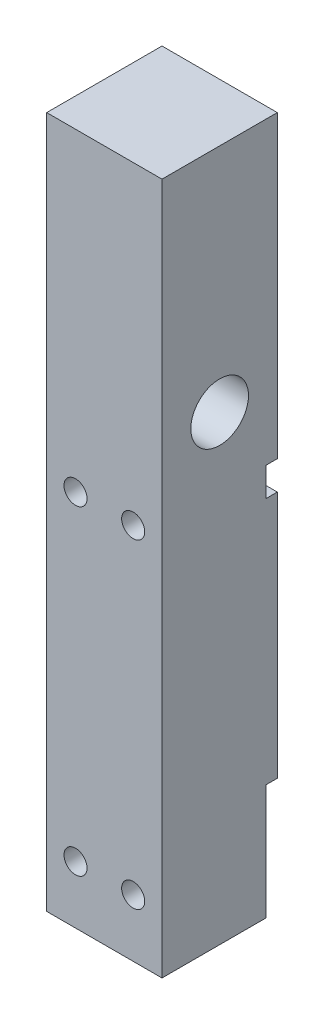
ISO-10303-21;
HEADER;
FILE_DESCRIPTION(('STEP AP214'),'2;1');
FILE_NAME('part.step','',(''),(''),'','','');
FILE_SCHEMA(('AUTOMOTIVE_DESIGN { 1 0 10303 214 1 1 1 1 }'));
ENDSEC;
DATA;
#1=APPLICATION_CONTEXT('core data for automotive mechanical design processes');
#2=APPLICATION_PROTOCOL_DEFINITION('international standard','automotive_design',2000,#1);
#3=PRODUCT_CONTEXT('',#1,'mechanical');
#4=PRODUCT('Part','Part','',(#3));
#5=PRODUCT_RELATED_PRODUCT_CATEGORY('part','',(#4));
#6=PRODUCT_DEFINITION_FORMATION('','',#4);
#7=PRODUCT_DEFINITION_CONTEXT('part definition',#1,'design');
#8=PRODUCT_DEFINITION('design','',#6,#7);
#9=PRODUCT_DEFINITION_SHAPE('','',#8);
#10=(LENGTH_UNIT() NAMED_UNIT(*) SI_UNIT(.MILLI.,.METRE.));
#11=(NAMED_UNIT(*) PLANE_ANGLE_UNIT() SI_UNIT($,.RADIAN.));
#12=(NAMED_UNIT(*) SI_UNIT($,.STERADIAN.) SOLID_ANGLE_UNIT());
#13=UNCERTAINTY_MEASURE_WITH_UNIT(LENGTH_MEASURE(1.E-05),#10,'distance_accuracy_value','');
#14=(GEOMETRIC_REPRESENTATION_CONTEXT(3) GLOBAL_UNCERTAINTY_ASSIGNED_CONTEXT((#13)) GLOBAL_UNIT_ASSIGNED_CONTEXT((#10,
#11,#12)) REPRESENTATION_CONTEXT('',''));
#15=CARTESIAN_POINT('',(0.,0.,0.));
#16=DIRECTION('',(0.,0.,1.));
#17=DIRECTION('',(1.,0.,0.));
#18=AXIS2_PLACEMENT_3D('',#15,#16,#17);
#19=CARTESIAN_POINT('',(-20.,120.,-20.));
#20=DIRECTION('',(0.,0.,-1.));
#21=DIRECTION('',(0.,1.,0.));
#22=AXIS2_PLACEMENT_3D('',#19,#20,#21);
#23=PLANE('',#22);
#24=DIRECTION('',(-1.,0.,0.));
#25=VECTOR('',#24,1.);
#26=CARTESIAN_POINT('',(0.,63.,-20.));
#27=LINE('',#26,#25);
#28=CARTESIAN_POINT('',(0.,63.,-20.));
#29=VERTEX_POINT('',#28);
#30=CARTESIAN_POINT('',(-20.,63.,-20.));
#31=VERTEX_POINT('',#30);
#32=EDGE_CURVE('E134',#29,#31,#27,.T.);
#33=ORIENTED_EDGE('',*,*,#32,.F.);
#34=DIRECTION('',(0.,1.,0.));
#35=VECTOR('',#34,1.);
#36=CARTESIAN_POINT('',(0.,120.,-20.));
#37=LINE('',#36,#35);
#38=CARTESIAN_POINT('',(0.,20.,-20.));
#39=VERTEX_POINT('',#38);
#40=EDGE_CURVE('E229',#39,#29,#37,.T.);
#41=ORIENTED_EDGE('',*,*,#40,.F.);
#42=DIRECTION('',(1.,0.,0.));
#43=VECTOR('',#42,1.);
#44=CARTESIAN_POINT('',(0.,20.,-20.));
#45=LINE('',#44,#43);
#46=CARTESIAN_POINT('',(-20.,20.,-20.));
#47=VERTEX_POINT('',#46);
#48=EDGE_CURVE('E148',#47,#39,#45,.T.);
#49=ORIENTED_EDGE('',*,*,#48,.F.);
#50=DIRECTION('',(0.,1.,0.));
#51=VECTOR('',#50,1.);
#52=CARTESIAN_POINT('',(-20.,120.,-20.));
#53=LINE('',#52,#51);
#54=EDGE_CURVE('E217',#47,#31,#53,.T.);
#55=ORIENTED_EDGE('',*,*,#54,.T.);
#56=EDGE_LOOP('',(#33,#41,#49,#55));
#57=FACE_BOUND('',#56,.T.);
#58=ADVANCED_FACE('F40',(#57),#23,.T.);
#59=CARTESIAN_POINT('',(-5.,9.99999999999999,-20.));
#60=DIRECTION('',(0.,0.,1.));
#61=DIRECTION('',(1.,0.,0.));
#62=AXIS2_PLACEMENT_3D('',#59,#60,#61);
#63=CYLINDRICAL_SURFACE('',#62,1.);
#64=CARTESIAN_POINT('',(-5.,9.99999999999999,-5.));
#65=DIRECTION('',(0.,0.,1.));
#66=DIRECTION('',(1.,0.,0.));
#67=AXIS2_PLACEMENT_3D('',#64,#65,#66);
#68=CIRCLE('',#67,1.);
#69=CARTESIAN_POINT('',(-4.,9.99999999999999,-5.));
#70=VERTEX_POINT('',#69);
#71=EDGE_CURVE('E204',#70,#70,#68,.T.);
#72=ORIENTED_EDGE('',*,*,#71,.T.);
#73=EDGE_LOOP('',(#72));
#74=FACE_BOUND('',#73,.T.);
#75=CARTESIAN_POINT('',(-5.,9.99999999999999,-18.));
#76=DIRECTION('',(0.,0.,-1.));
#77=DIRECTION('',(-1.,0.,0.));
#78=AXIS2_PLACEMENT_3D('',#75,#76,#77);
#79=CIRCLE('',#78,1.);
#80=CARTESIAN_POINT('',(-6.,9.99999999999999,-18.));
#81=VERTEX_POINT('',#80);
#82=EDGE_CURVE('E167',#81,#81,#79,.T.);
#83=ORIENTED_EDGE('',*,*,#82,.T.);
#84=EDGE_LOOP('',(#83));
#85=FACE_BOUND('',#84,.T.);
#86=ADVANCED_FACE('F305',(#74,#85),#63,.F.);
#87=CARTESIAN_POINT('',(-15.,9.99999999999999,-20.));
#88=DIRECTION('',(0.,0.,1.));
#89=DIRECTION('',(1.,0.,0.));
#90=AXIS2_PLACEMENT_3D('',#87,#88,#89);
#91=CYLINDRICAL_SURFACE('',#90,1.);
#92=CARTESIAN_POINT('',(-15.,9.99999999999999,-5.));
#93=DIRECTION('',(0.,0.,1.));
#94=DIRECTION('',(1.,0.,0.));
#95=AXIS2_PLACEMENT_3D('',#92,#93,#94);
#96=CIRCLE('',#95,1.);
#97=CARTESIAN_POINT('',(-14.,9.99999999999999,-5.));
#98=VERTEX_POINT('',#97);
#99=EDGE_CURVE('E194',#98,#98,#96,.F.);
#100=ORIENTED_EDGE('',*,*,#99,.F.);
#101=EDGE_LOOP('',(#100));
#102=FACE_BOUND('',#101,.T.);
#103=CARTESIAN_POINT('',(-15.,9.99999999999999,-18.));
#104=DIRECTION('',(0.,0.,-1.));
#105=DIRECTION('',(-1.,0.,0.));
#106=AXIS2_PLACEMENT_3D('',#103,#104,#105);
#107=CIRCLE('',#106,1.);
#108=CARTESIAN_POINT('',(-16.,9.99999999999999,-18.));
#109=VERTEX_POINT('',#108);
#110=EDGE_CURVE('E164',#109,#109,#107,.F.);
#111=ORIENTED_EDGE('',*,*,#110,.F.);
#112=EDGE_LOOP('',(#111));
#113=FACE_BOUND('',#112,.T.);
#114=ADVANCED_FACE('F309',(#102,#113),#91,.F.);
#115=CARTESIAN_POINT('',(-20.,0.,0.));
#116=DIRECTION('',(0.,-1.,0.));
#117=DIRECTION('',(0.,0.,-1.));
#118=AXIS2_PLACEMENT_3D('',#115,#116,#117);
#119=PLANE('',#118);
#120=DIRECTION('',(0.,0.,-1.));
#121=VECTOR('',#120,1.);
#122=CARTESIAN_POINT('',(-20.,0.,0.));
#123=LINE('',#122,#121);
#124=CARTESIAN_POINT('',(-20.,0.,0.));
#125=VERTEX_POINT('',#124);
#126=CARTESIAN_POINT('',(-20.,0.,-18.));
#127=VERTEX_POINT('',#126);
#128=EDGE_CURVE('E212',#125,#127,#123,.T.);
#129=ORIENTED_EDGE('',*,*,#128,.T.);
#130=DIRECTION('',(-1.,0.,0.));
#131=VECTOR('',#130,1.);
#132=CARTESIAN_POINT('',(0.,0.,-18.));
#133=LINE('',#132,#131);
#134=CARTESIAN_POINT('',(0.,0.,-18.));
#135=VERTEX_POINT('',#134);
#136=EDGE_CURVE('E152',#135,#127,#133,.T.);
#137=ORIENTED_EDGE('',*,*,#136,.F.);
#138=DIRECTION('',(0.,0.,-1.));
#139=VECTOR('',#138,1.);
#140=CARTESIAN_POINT('',(0.,0.,0.));
#141=LINE('',#140,#139);
#142=CARTESIAN_POINT('',(0.,0.,0.));
#143=VERTEX_POINT('',#142);
#144=EDGE_CURVE('E224',#143,#135,#141,.T.);
#145=ORIENTED_EDGE('',*,*,#144,.F.);
#146=DIRECTION('',(1.,0.,0.));
#147=VECTOR('',#146,1.);
#148=CARTESIAN_POINT('',(-20.,0.,0.));
#149=LINE('',#148,#147);
#150=EDGE_CURVE('E221',#125,#143,#149,.T.);
#151=ORIENTED_EDGE('',*,*,#150,.F.);
#152=EDGE_LOOP('',(#129,#137,#145,#151));
#153=FACE_BOUND('',#152,.T.);
#154=ADVANCED_FACE('F286',(#153),#119,.T.);
#155=CARTESIAN_POINT('',(-15.,65.5,-20.));
#156=DIRECTION('',(0.,0.,1.));
#157=DIRECTION('',(1.,0.,0.));
#158=AXIS2_PLACEMENT_3D('',#155,#156,#157);
#159=CYLINDRICAL_SURFACE('',#158,1.);
#160=CARTESIAN_POINT('',(-15.,65.5,-5.));
#161=DIRECTION('',(0.,0.,1.));
#162=DIRECTION('',(1.,0.,0.));
#163=AXIS2_PLACEMENT_3D('',#160,#161,#162);
#164=CIRCLE('',#163,1.);
#165=CARTESIAN_POINT('',(-14.,65.5,-5.));
#166=VERTEX_POINT('',#165);
#167=EDGE_CURVE('E170',#166,#166,#164,.T.);
#168=ORIENTED_EDGE('',*,*,#167,.T.);
#169=EDGE_LOOP('',(#168));
#170=FACE_BOUND('',#169,.T.);
#171=CARTESIAN_POINT('',(-15.,65.5,-18.));
#172=DIRECTION('',(0.,0.,-1.));
#173=DIRECTION('',(-1.,0.,0.));
#174=AXIS2_PLACEMENT_3D('',#171,#172,#173);
#175=CIRCLE('',#174,1.);
#176=CARTESIAN_POINT('',(-16.,65.5,-18.));
#177=VERTEX_POINT('',#176);
#178=EDGE_CURVE('E161',#177,#177,#175,.F.);
#179=ORIENTED_EDGE('',*,*,#178,.F.);
#180=EDGE_LOOP('',(#179));
#181=FACE_BOUND('',#180,.T.);
#182=ADVANCED_FACE('F252',(#170,#181),#159,.F.);
#183=CARTESIAN_POINT('',(-5.,65.5,-20.));
#184=DIRECTION('',(0.,0.,1.));
#185=DIRECTION('',(1.,0.,0.));
#186=AXIS2_PLACEMENT_3D('',#183,#184,#185);
#187=CYLINDRICAL_SURFACE('',#186,1.);
#188=CARTESIAN_POINT('',(-5.,65.5,-5.));
#189=DIRECTION('',(0.,0.,1.));
#190=DIRECTION('',(1.,0.,0.));
#191=AXIS2_PLACEMENT_3D('',#188,#189,#190);
#192=CIRCLE('',#191,1.);
#193=CARTESIAN_POINT('',(-4.,65.5,-5.));
#194=VERTEX_POINT('',#193);
#195=EDGE_CURVE('E178',#194,#194,#192,.F.);
#196=ORIENTED_EDGE('',*,*,#195,.F.);
#197=EDGE_LOOP('',(#196));
#198=FACE_BOUND('',#197,.T.);
#199=CARTESIAN_POINT('',(-5.,65.5,-18.));
#200=DIRECTION('',(0.,0.,-1.));
#201=DIRECTION('',(-1.,0.,0.));
#202=AXIS2_PLACEMENT_3D('',#199,#200,#201);
#203=CIRCLE('',#202,1.);
#204=CARTESIAN_POINT('',(-6.,65.5,-18.));
#205=VERTEX_POINT('',#204);
#206=EDGE_CURVE('E44',#205,#205,#203,.T.);
#207=ORIENTED_EDGE('',*,*,#206,.T.);
#208=EDGE_LOOP('',(#207));
#209=FACE_BOUND('',#208,.T.);
#210=ADVANCED_FACE('F248',(#198,#209),#187,.F.);
#211=DIRECTION('',(1.,0.,0.));
#212=VECTOR('',#211,1.);
#213=CARTESIAN_POINT('',(0.,68.,-20.));
#214=LINE('',#213,#212);
#215=CARTESIAN_POINT('',(-20.,68.,-20.));
#216=VERTEX_POINT('',#215);
#217=CARTESIAN_POINT('',(0.,68.,-20.));
#218=VERTEX_POINT('',#217);
#219=EDGE_CURVE('E159',#216,#218,#214,.T.);
#220=ORIENTED_EDGE('',*,*,#219,.F.);
#221=CARTESIAN_POINT('',(-20.,120.,-20.));
#222=VERTEX_POINT('',#221);
#223=EDGE_CURVE('E139',#216,#222,#53,.T.);
#224=ORIENTED_EDGE('',*,*,#223,.T.);
#225=DIRECTION('',(1.,0.,0.));
#226=VECTOR('',#225,1.);
#227=CARTESIAN_POINT('',(-20.,120.,-20.));
#228=LINE('',#227,#226);
#229=CARTESIAN_POINT('',(0.,120.,-20.));
#230=VERTEX_POINT('',#229);
#231=EDGE_CURVE('E49',#222,#230,#228,.T.);
#232=ORIENTED_EDGE('',*,*,#231,.T.);
#233=EDGE_CURVE('E227',#218,#230,#37,.T.);
#234=ORIENTED_EDGE('',*,*,#233,.F.);
#235=EDGE_LOOP('',(#220,#224,#232,#234));
#236=FACE_BOUND('',#235,.T.);
#237=ADVANCED_FACE('F251',(#236),#23,.T.);
#238=CARTESIAN_POINT('',(-20.,120.,0.));
#239=DIRECTION('',(0.,0.,1.));
#240=DIRECTION('',(0.,-1.,0.));
#241=AXIS2_PLACEMENT_3D('',#238,#239,#240);
#242=PLANE('',#241);
#243=CARTESIAN_POINT('',(-5.,9.99999999999999,0.));
#244=DIRECTION('',(0.,0.,1.));
#245=DIRECTION('',(1.,0.,0.));
#246=AXIS2_PLACEMENT_3D('',#243,#244,#245);
#247=CIRCLE('',#246,2.);
#248=CARTESIAN_POINT('',(-3.,9.99999999999999,0.));
#249=VERTEX_POINT('',#248);
#250=EDGE_CURVE('E183',#249,#249,#247,.T.);
#251=ORIENTED_EDGE('',*,*,#250,.F.);
#252=EDGE_LOOP('',(#251));
#253=FACE_BOUND('',#252,.T.);
#254=CARTESIAN_POINT('',(-15.,65.5,0.));
#255=DIRECTION('',(0.,0.,1.));
#256=DIRECTION('',(1.,0.,0.));
#257=AXIS2_PLACEMENT_3D('',#254,#255,#256);
#258=CIRCLE('',#257,2.);
#259=CARTESIAN_POINT('',(-13.,65.5,0.));
#260=VERTEX_POINT('',#259);
#261=EDGE_CURVE('E174',#260,#260,#258,.T.);
#262=ORIENTED_EDGE('',*,*,#261,.F.);
#263=EDGE_LOOP('',(#262));
#264=FACE_BOUND('',#263,.T.);
#265=CARTESIAN_POINT('',(-5.,65.5,0.));
#266=DIRECTION('',(0.,0.,1.));
#267=DIRECTION('',(1.,0.,0.));
#268=AXIS2_PLACEMENT_3D('',#265,#266,#267);
#269=CIRCLE('',#268,2.);
#270=CARTESIAN_POINT('',(-3.,65.5,0.));
#271=VERTEX_POINT('',#270);
#272=EDGE_CURVE('E175',#271,#271,#269,.T.);
#273=ORIENTED_EDGE('',*,*,#272,.F.);
#274=EDGE_LOOP('',(#273));
#275=FACE_BOUND('',#274,.T.);
#276=CARTESIAN_POINT('',(-15.,9.99999999999999,0.));
#277=DIRECTION('',(0.,0.,1.));
#278=DIRECTION('',(1.,0.,0.));
#279=AXIS2_PLACEMENT_3D('',#276,#277,#278);
#280=CIRCLE('',#279,2.);
#281=CARTESIAN_POINT('',(-13.,9.99999999999999,0.));
#282=VERTEX_POINT('',#281);
#283=EDGE_CURVE('E182',#282,#282,#280,.T.);
#284=ORIENTED_EDGE('',*,*,#283,.F.);
#285=EDGE_LOOP('',(#284));
#286=FACE_BOUND('',#285,.T.);
#287=DIRECTION('',(0.,-1.,0.));
#288=VECTOR('',#287,1.);
#289=CARTESIAN_POINT('',(0.,120.,0.));
#290=LINE('',#289,#288);
#291=CARTESIAN_POINT('',(0.,120.,0.));
#292=VERTEX_POINT('',#291);
#293=EDGE_CURVE('E208',#292,#143,#290,.T.);
#294=ORIENTED_EDGE('',*,*,#293,.F.);
#295=DIRECTION('',(1.,0.,0.));
#296=VECTOR('',#295,1.);
#297=CARTESIAN_POINT('',(-20.,120.,0.));
#298=LINE('',#297,#296);
#299=CARTESIAN_POINT('',(-20.,120.,0.));
#300=VERTEX_POINT('',#299);
#301=EDGE_CURVE('E12',#300,#292,#298,.T.);
#302=ORIENTED_EDGE('',*,*,#301,.F.);
#303=DIRECTION('',(0.,-1.,0.));
#304=VECTOR('',#303,1.);
#305=CARTESIAN_POINT('',(-20.,120.,0.));
#306=LINE('',#305,#304);
#307=EDGE_CURVE('E209',#300,#125,#306,.T.);
#308=ORIENTED_EDGE('',*,*,#307,.T.);
#309=ORIENTED_EDGE('',*,*,#150,.T.);
#310=EDGE_LOOP('',(#294,#302,#308,#309));
#311=FACE_BOUND('',#310,.T.);
#312=ADVANCED_FACE('F42',(#253,#264,#275,#286,#311),#242,.T.);
#313=CARTESIAN_POINT('',(-20.,80.,-10.));
#314=DIRECTION('',(1.,0.,0.));
#315=DIRECTION('',(0.,0.,-1.));
#316=AXIS2_PLACEMENT_3D('',#313,#314,#315);
#317=CYLINDRICAL_SURFACE('',#316,2.5);
#318=CARTESIAN_POINT('',(-20.,80.,-10.));
#319=DIRECTION('',(1.,0.,0.));
#320=DIRECTION('',(0.,0.,-1.));
#321=AXIS2_PLACEMENT_3D('',#318,#319,#320);
#322=CIRCLE('',#321,2.5);
#323=CARTESIAN_POINT('',(-20.,80.,-12.5));
#324=VERTEX_POINT('',#323);
#325=EDGE_CURVE('E205',#324,#324,#322,.T.);
#326=ORIENTED_EDGE('',*,*,#325,.F.);
#327=EDGE_LOOP('',(#326));
#328=FACE_BOUND('',#327,.T.);
#329=CARTESIAN_POINT('',(-10.,80.,-10.));
#330=DIRECTION('',(1.,0.,0.));
#331=DIRECTION('',(0.,0.,-1.));
#332=AXIS2_PLACEMENT_3D('',#329,#330,#331);
#333=CIRCLE('',#332,2.5);
#334=CARTESIAN_POINT('',(-10.,80.,-12.5));
#335=VERTEX_POINT('',#334);
#336=EDGE_CURVE('E200',#335,#335,#333,.F.);
#337=ORIENTED_EDGE('',*,*,#336,.F.);
#338=EDGE_LOOP('',(#337));
#339=FACE_BOUND('',#338,.T.);
#340=ADVANCED_FACE('F301',(#328,#339),#317,.F.);
#341=CARTESIAN_POINT('',(-20.,120.,0.));
#342=DIRECTION('',(0.,1.,0.));
#343=DIRECTION('',(0.,0.,1.));
#344=AXIS2_PLACEMENT_3D('',#341,#342,#343);
#345=PLANE('',#344);
#346=DIRECTION('',(0.,0.,1.));
#347=VECTOR('',#346,1.);
#348=CARTESIAN_POINT('',(0.,120.,0.));
#349=LINE('',#348,#347);
#350=EDGE_CURVE('E213',#230,#292,#349,.T.);
#351=ORIENTED_EDGE('',*,*,#350,.F.);
#352=ORIENTED_EDGE('',*,*,#231,.F.);
#353=DIRECTION('',(0.,0.,1.));
#354=VECTOR('',#353,1.);
#355=CARTESIAN_POINT('',(-20.,120.,0.));
#356=LINE('',#355,#354);
#357=EDGE_CURVE('E218',#222,#300,#356,.T.);
#358=ORIENTED_EDGE('',*,*,#357,.T.);
#359=ORIENTED_EDGE('',*,*,#301,.T.);
#360=EDGE_LOOP('',(#351,#352,#358,#359));
#361=FACE_BOUND('',#360,.T.);
#362=ADVANCED_FACE('F293',(#361),#345,.T.);
#363=CARTESIAN_POINT('',(-20.,0.,0.));
#364=DIRECTION('',(1.,0.,0.));
#365=DIRECTION('',(0.,0.,-1.));
#366=AXIS2_PLACEMENT_3D('',#363,#364,#365);
#367=PLANE('',#366);
#368=ORIENTED_EDGE('',*,*,#325,.T.);
#369=EDGE_LOOP('',(#368));
#370=FACE_BOUND('',#369,.T.);
#371=DIRECTION('',(0.,1.,0.));
#372=VECTOR('',#371,1.);
#373=CARTESIAN_POINT('',(-20.,68.,-18.));
#374=LINE('',#373,#372);
#375=CARTESIAN_POINT('',(-20.,63.,-18.));
#376=VERTEX_POINT('',#375);
#377=CARTESIAN_POINT('',(-20.,68.,-18.));
#378=VERTEX_POINT('',#377);
#379=EDGE_CURVE('E124',#376,#378,#374,.T.);
#380=ORIENTED_EDGE('',*,*,#379,.F.);
#381=DIRECTION('',(0.,0.,-1.));
#382=VECTOR('',#381,1.);
#383=CARTESIAN_POINT('',(-20.,63.,-18.));
#384=LINE('',#383,#382);
#385=EDGE_CURVE('E257',#376,#31,#384,.T.);
#386=ORIENTED_EDGE('',*,*,#385,.T.);
#387=ORIENTED_EDGE('',*,*,#54,.F.);
#388=DIRECTION('',(0.,0.,-1.));
#389=VECTOR('',#388,1.);
#390=CARTESIAN_POINT('',(-20.,20.,-18.));
#391=LINE('',#390,#389);
#392=CARTESIAN_POINT('',(-20.,20.,-18.));
#393=VERTEX_POINT('',#392);
#394=EDGE_CURVE('E154',#393,#47,#391,.T.);
#395=ORIENTED_EDGE('',*,*,#394,.F.);
#396=DIRECTION('',(0.,1.,0.));
#397=VECTOR('',#396,1.);
#398=CARTESIAN_POINT('',(-20.,20.,-18.));
#399=LINE('',#398,#397);
#400=EDGE_CURVE('E146',#127,#393,#399,.T.);
#401=ORIENTED_EDGE('',*,*,#400,.F.);
#402=ORIENTED_EDGE('',*,*,#128,.F.);
#403=ORIENTED_EDGE('',*,*,#307,.F.);
#404=ORIENTED_EDGE('',*,*,#357,.F.);
#405=ORIENTED_EDGE('',*,*,#223,.F.);
#406=DIRECTION('',(0.,0.,-1.));
#407=VECTOR('',#406,1.);
#408=CARTESIAN_POINT('',(-20.,68.,-18.));
#409=LINE('',#408,#407);
#410=EDGE_CURVE('E118',#378,#216,#409,.T.);
#411=ORIENTED_EDGE('',*,*,#410,.F.);
#412=EDGE_LOOP('',(#380,#386,#387,#395,#401,#402,#403,#404,#405,#411));
#413=FACE_BOUND('',#412,.T.);
#414=ADVANCED_FACE('F137',(#370,#413),#367,.F.);
#415=CARTESIAN_POINT('',(0.,0.,0.));
#416=DIRECTION('',(1.,0.,0.));
#417=DIRECTION('',(0.,0.,-1.));
#418=AXIS2_PLACEMENT_3D('',#415,#416,#417);
#419=PLANE('',#418);
#420=DIRECTION('',(0.,0.,-1.));
#421=VECTOR('',#420,1.);
#422=CARTESIAN_POINT('',(0.,63.,-18.));
#423=LINE('',#422,#421);
#424=CARTESIAN_POINT('',(0.,63.,-18.));
#425=VERTEX_POINT('',#424);
#426=EDGE_CURVE('E141',#425,#29,#423,.T.);
#427=ORIENTED_EDGE('',*,*,#426,.F.);
#428=DIRECTION('',(0.,-1.,0.));
#429=VECTOR('',#428,1.);
#430=CARTESIAN_POINT('',(0.,68.,-18.));
#431=LINE('',#430,#429);
#432=CARTESIAN_POINT('',(0.,68.,-18.));
#433=VERTEX_POINT('',#432);
#434=EDGE_CURVE('E123',#433,#425,#431,.T.);
#435=ORIENTED_EDGE('',*,*,#434,.F.);
#436=DIRECTION('',(0.,0.,-1.));
#437=VECTOR('',#436,1.);
#438=CARTESIAN_POINT('',(0.,68.,-18.));
#439=LINE('',#438,#437);
#440=EDGE_CURVE('E121',#433,#218,#439,.T.);
#441=ORIENTED_EDGE('',*,*,#440,.T.);
#442=ORIENTED_EDGE('',*,*,#233,.T.);
#443=ORIENTED_EDGE('',*,*,#350,.T.);
#444=ORIENTED_EDGE('',*,*,#293,.T.);
#445=ORIENTED_EDGE('',*,*,#144,.T.);
#446=DIRECTION('',(0.,-1.,0.));
#447=VECTOR('',#446,1.);
#448=CARTESIAN_POINT('',(0.,20.,-18.));
#449=LINE('',#448,#447);
#450=CARTESIAN_POINT('',(0.,20.,-18.));
#451=VERTEX_POINT('',#450);
#452=EDGE_CURVE('E150',#451,#135,#449,.T.);
#453=ORIENTED_EDGE('',*,*,#452,.F.);
#454=DIRECTION('',(0.,0.,-1.));
#455=VECTOR('',#454,1.);
#456=CARTESIAN_POINT('',(0.,20.,-18.));
#457=LINE('',#456,#455);
#458=EDGE_CURVE('E156',#451,#39,#457,.T.);
#459=ORIENTED_EDGE('',*,*,#458,.T.);
#460=ORIENTED_EDGE('',*,*,#40,.T.);
#461=EDGE_LOOP('',(#427,#435,#441,#442,#443,#444,#445,#453,#459,#460));
#462=FACE_BOUND('',#461,.T.);
#463=CARTESIAN_POINT('',(0.,80.,-10.));
#464=DIRECTION('',(1.,0.,0.));
#465=DIRECTION('',(0.,0.,-1.));
#466=AXIS2_PLACEMENT_3D('',#463,#464,#465);
#467=CIRCLE('',#466,5.);
#468=CARTESIAN_POINT('',(0.,80.,-15.));
#469=VERTEX_POINT('',#468);
#470=EDGE_CURVE('E201',#469,#469,#467,.T.);
#471=ORIENTED_EDGE('',*,*,#470,.F.);
#472=EDGE_LOOP('',(#471));
#473=FACE_BOUND('',#472,.T.);
#474=ADVANCED_FACE('F270',(#462,#473),#419,.T.);
#475=CARTESIAN_POINT('',(-10.,80.,-10.));
#476=DIRECTION('',(1.,0.,0.));
#477=DIRECTION('',(0.,0.,-1.));
#478=AXIS2_PLACEMENT_3D('',#475,#476,#477);
#479=PLANE('',#478);
#480=CARTESIAN_POINT('',(-10.,80.,-10.));
#481=DIRECTION('',(1.,0.,0.));
#482=DIRECTION('',(0.,0.,-1.));
#483=AXIS2_PLACEMENT_3D('',#480,#481,#482);
#484=CIRCLE('',#483,5.);
#485=CARTESIAN_POINT('',(-10.,80.,-15.));
#486=VERTEX_POINT('',#485);
#487=EDGE_CURVE('E197',#486,#486,#484,.T.);
#488=ORIENTED_EDGE('',*,*,#487,.T.);
#489=EDGE_LOOP('',(#488));
#490=FACE_BOUND('',#489,.T.);
#491=ORIENTED_EDGE('',*,*,#336,.T.);
#492=EDGE_LOOP('',(#491));
#493=FACE_BOUND('',#492,.T.);
#494=ADVANCED_FACE('F320',(#490,#493),#479,.T.);
#495=CARTESIAN_POINT('',(-10.,80.,-10.));
#496=DIRECTION('',(1.,0.,0.));
#497=DIRECTION('',(0.,0.,-1.));
#498=AXIS2_PLACEMENT_3D('',#495,#496,#497);
#499=CYLINDRICAL_SURFACE('',#498,5.);
#500=ORIENTED_EDGE('',*,*,#487,.F.);
#501=EDGE_LOOP('',(#500));
#502=FACE_BOUND('',#501,.T.);
#503=ORIENTED_EDGE('',*,*,#470,.T.);
#504=EDGE_LOOP('',(#503));
#505=FACE_BOUND('',#504,.T.);
#506=ADVANCED_FACE('F323',(#502,#505),#499,.F.);
#507=CARTESIAN_POINT('',(-15.,9.99999999999999,-5.));
#508=DIRECTION('',(0.,0.,1.));
#509=DIRECTION('',(1.,0.,0.));
#510=AXIS2_PLACEMENT_3D('',#507,#508,#509);
#511=PLANE('',#510);
#512=CARTESIAN_POINT('',(-15.,9.99999999999999,-5.));
#513=DIRECTION('',(0.,0.,1.));
#514=DIRECTION('',(1.,0.,0.));
#515=AXIS2_PLACEMENT_3D('',#512,#513,#514);
#516=CIRCLE('',#515,2.);
#517=CARTESIAN_POINT('',(-13.,9.99999999999999,-5.));
#518=VERTEX_POINT('',#517);
#519=EDGE_CURVE('E191',#518,#518,#516,.T.);
#520=ORIENTED_EDGE('',*,*,#519,.T.);
#521=EDGE_LOOP('',(#520));
#522=FACE_BOUND('',#521,.T.);
#523=ORIENTED_EDGE('',*,*,#99,.T.);
#524=EDGE_LOOP('',(#523));
#525=FACE_BOUND('',#524,.T.);
#526=ADVANCED_FACE('F327',(#522,#525),#511,.T.);
#527=CARTESIAN_POINT('',(-15.,9.99999999999999,-5.));
#528=DIRECTION('',(0.,0.,1.));
#529=DIRECTION('',(1.,0.,0.));
#530=AXIS2_PLACEMENT_3D('',#527,#528,#529);
#531=CYLINDRICAL_SURFACE('',#530,2.);
#532=ORIENTED_EDGE('',*,*,#519,.F.);
#533=EDGE_LOOP('',(#532));
#534=FACE_BOUND('',#533,.T.);
#535=ORIENTED_EDGE('',*,*,#283,.T.);
#536=EDGE_LOOP('',(#535));
#537=FACE_BOUND('',#536,.T.);
#538=ADVANCED_FACE('F365',(#534,#537),#531,.F.);
#539=CARTESIAN_POINT('',(-5.,9.99999999999999,-5.));
#540=DIRECTION('',(0.,0.,1.));
#541=DIRECTION('',(1.,0.,0.));
#542=AXIS2_PLACEMENT_3D('',#539,#540,#541);
#543=CYLINDRICAL_SURFACE('',#542,2.);
#544=CARTESIAN_POINT('',(-5.,9.99999999999999,-5.));
#545=DIRECTION('',(0.,0.,1.));
#546=DIRECTION('',(1.,0.,0.));
#547=AXIS2_PLACEMENT_3D('',#544,#545,#546);
#548=CIRCLE('',#547,2.);
#549=CARTESIAN_POINT('',(-3.,9.99999999999999,-5.));
#550=VERTEX_POINT('',#549);
#551=EDGE_CURVE('E179',#550,#550,#548,.T.);
#552=ORIENTED_EDGE('',*,*,#551,.F.);
#553=EDGE_LOOP('',(#552));
#554=FACE_BOUND('',#553,.T.);
#555=ORIENTED_EDGE('',*,*,#250,.T.);
#556=EDGE_LOOP('',(#555));
#557=FACE_BOUND('',#556,.T.);
#558=ADVANCED_FACE('F373',(#554,#557),#543,.F.);
#559=CARTESIAN_POINT('',(-5.,9.99999999999999,-5.));
#560=DIRECTION('',(0.,0.,1.));
#561=DIRECTION('',(1.,0.,0.));
#562=AXIS2_PLACEMENT_3D('',#559,#560,#561);
#563=PLANE('',#562);
#564=ORIENTED_EDGE('',*,*,#71,.F.);
#565=EDGE_LOOP('',(#564));
#566=FACE_BOUND('',#565,.T.);
#567=ORIENTED_EDGE('',*,*,#551,.T.);
#568=EDGE_LOOP('',(#567));
#569=FACE_BOUND('',#568,.T.);
#570=ADVANCED_FACE('F380',(#566,#569),#563,.T.);
#571=CARTESIAN_POINT('',(-5.,65.5,-5.));
#572=DIRECTION('',(0.,0.,1.));
#573=DIRECTION('',(1.,0.,0.));
#574=AXIS2_PLACEMENT_3D('',#571,#572,#573);
#575=CYLINDRICAL_SURFACE('',#574,2.);
#576=CARTESIAN_POINT('',(-5.,65.5,-5.));
#577=DIRECTION('',(0.,0.,1.));
#578=DIRECTION('',(1.,0.,0.));
#579=AXIS2_PLACEMENT_3D('',#576,#577,#578);
#580=CIRCLE('',#579,2.);
#581=CARTESIAN_POINT('',(-3.,65.5,-5.));
#582=VERTEX_POINT('',#581);
#583=EDGE_CURVE('E171',#582,#582,#580,.T.);
#584=ORIENTED_EDGE('',*,*,#583,.F.);
#585=EDGE_LOOP('',(#584));
#586=FACE_BOUND('',#585,.T.);
#587=ORIENTED_EDGE('',*,*,#272,.T.);
#588=EDGE_LOOP('',(#587));
#589=FACE_BOUND('',#588,.T.);
#590=ADVANCED_FACE('F388',(#586,#589),#575,.F.);
#591=CARTESIAN_POINT('',(-5.,65.5,-5.));
#592=DIRECTION('',(0.,0.,1.));
#593=DIRECTION('',(1.,0.,0.));
#594=AXIS2_PLACEMENT_3D('',#591,#592,#593);
#595=PLANE('',#594);
#596=ORIENTED_EDGE('',*,*,#195,.T.);
#597=EDGE_LOOP('',(#596));
#598=FACE_BOUND('',#597,.T.);
#599=ORIENTED_EDGE('',*,*,#583,.T.);
#600=EDGE_LOOP('',(#599));
#601=FACE_BOUND('',#600,.T.);
#602=ADVANCED_FACE('F245',(#598,#601),#595,.T.);
#603=CARTESIAN_POINT('',(-15.,65.5,-5.));
#604=DIRECTION('',(0.,0.,1.));
#605=DIRECTION('',(1.,0.,0.));
#606=AXIS2_PLACEMENT_3D('',#603,#604,#605);
#607=CYLINDRICAL_SURFACE('',#606,2.);
#608=CARTESIAN_POINT('',(-15.,65.5,-5.));
#609=DIRECTION('',(0.,0.,1.));
#610=DIRECTION('',(1.,0.,0.));
#611=AXIS2_PLACEMENT_3D('',#608,#609,#610);
#612=CIRCLE('',#611,2.);
#613=CARTESIAN_POINT('',(-13.,65.5,-5.));
#614=VERTEX_POINT('',#613);
#615=EDGE_CURVE('E186',#614,#614,#612,.T.);
#616=ORIENTED_EDGE('',*,*,#615,.F.);
#617=EDGE_LOOP('',(#616));
#618=FACE_BOUND('',#617,.T.);
#619=ORIENTED_EDGE('',*,*,#261,.T.);
#620=EDGE_LOOP('',(#619));
#621=FACE_BOUND('',#620,.T.);
#622=ADVANCED_FACE('F404',(#618,#621),#607,.F.);
#623=CARTESIAN_POINT('',(-15.,65.5,-5.));
#624=DIRECTION('',(0.,0.,1.));
#625=DIRECTION('',(1.,0.,0.));
#626=AXIS2_PLACEMENT_3D('',#623,#624,#625);
#627=PLANE('',#626);
#628=ORIENTED_EDGE('',*,*,#167,.F.);
#629=EDGE_LOOP('',(#628));
#630=FACE_BOUND('',#629,.T.);
#631=ORIENTED_EDGE('',*,*,#615,.T.);
#632=EDGE_LOOP('',(#631));
#633=FACE_BOUND('',#632,.T.);
#634=ADVANCED_FACE('F411',(#630,#633),#627,.T.);
#635=CARTESIAN_POINT('',(0.,0.,-18.));
#636=DIRECTION('',(0.,0.,-1.));
#637=DIRECTION('',(-1.,0.,0.));
#638=AXIS2_PLACEMENT_3D('',#635,#636,#637);
#639=PLANE('',#638);
#640=ORIENTED_EDGE('',*,*,#206,.F.);
#641=EDGE_LOOP('',(#640));
#642=FACE_BOUND('',#641,.T.);
#643=ORIENTED_EDGE('',*,*,#379,.T.);
#644=DIRECTION('',(1.,0.,0.));
#645=VECTOR('',#644,1.);
#646=CARTESIAN_POINT('',(0.,68.,-18.));
#647=LINE('',#646,#645);
#648=EDGE_CURVE('E57',#378,#433,#647,.T.);
#649=ORIENTED_EDGE('',*,*,#648,.T.);
#650=ORIENTED_EDGE('',*,*,#434,.T.);
#651=DIRECTION('',(-1.,0.,0.));
#652=VECTOR('',#651,1.);
#653=CARTESIAN_POINT('',(0.,63.,-18.));
#654=LINE('',#653,#652);
#655=EDGE_CURVE('E131',#425,#376,#654,.T.);
#656=ORIENTED_EDGE('',*,*,#655,.T.);
#657=EDGE_LOOP('',(#643,#649,#650,#656));
#658=FACE_BOUND('',#657,.T.);
#659=ORIENTED_EDGE('',*,*,#178,.T.);
#660=EDGE_LOOP('',(#659));
#661=FACE_BOUND('',#660,.T.);
#662=ADVANCED_FACE('F128',(#642,#658,#661),#639,.T.);
#663=CARTESIAN_POINT('',(0.,63.,-18.));
#664=DIRECTION('',(0.,-1.,0.));
#665=DIRECTION('',(0.,0.,-1.));
#666=AXIS2_PLACEMENT_3D('',#663,#664,#665);
#667=PLANE('',#666);
#668=ORIENTED_EDGE('',*,*,#32,.T.);
#669=ORIENTED_EDGE('',*,*,#385,.F.);
#670=ORIENTED_EDGE('',*,*,#655,.F.);
#671=ORIENTED_EDGE('',*,*,#426,.T.);
#672=EDGE_LOOP('',(#668,#669,#670,#671));
#673=FACE_BOUND('',#672,.T.);
#674=ADVANCED_FACE('F267',(#673),#667,.F.);
#675=CARTESIAN_POINT('',(0.,68.,-18.));
#676=DIRECTION('',(0.,1.,0.));
#677=DIRECTION('',(-1.,0.,0.));
#678=AXIS2_PLACEMENT_3D('',#675,#676,#677);
#679=PLANE('',#678);
#680=ORIENTED_EDGE('',*,*,#219,.T.);
#681=ORIENTED_EDGE('',*,*,#440,.F.);
#682=ORIENTED_EDGE('',*,*,#648,.F.);
#683=ORIENTED_EDGE('',*,*,#410,.T.);
#684=EDGE_LOOP('',(#680,#681,#682,#683));
#685=FACE_BOUND('',#684,.T.);
#686=ADVANCED_FACE('F116',(#685),#679,.F.);
#687=CARTESIAN_POINT('',(0.,0.,-18.));
#688=DIRECTION('',(0.,0.,-1.));
#689=DIRECTION('',(-1.,0.,0.));
#690=AXIS2_PLACEMENT_3D('',#687,#688,#689);
#691=PLANE('',#690);
#692=ORIENTED_EDGE('',*,*,#82,.F.);
#693=EDGE_LOOP('',(#692));
#694=FACE_BOUND('',#693,.T.);
#695=ORIENTED_EDGE('',*,*,#400,.T.);
#696=DIRECTION('',(1.,0.,0.));
#697=VECTOR('',#696,1.);
#698=CARTESIAN_POINT('',(0.,20.,-18.));
#699=LINE('',#698,#697);
#700=EDGE_CURVE('E65',#393,#451,#699,.T.);
#701=ORIENTED_EDGE('',*,*,#700,.T.);
#702=ORIENTED_EDGE('',*,*,#452,.T.);
#703=ORIENTED_EDGE('',*,*,#136,.T.);
#704=EDGE_LOOP('',(#695,#701,#702,#703));
#705=FACE_BOUND('',#704,.T.);
#706=ORIENTED_EDGE('',*,*,#110,.T.);
#707=EDGE_LOOP('',(#706));
#708=FACE_BOUND('',#707,.T.);
#709=ADVANCED_FACE('F281',(#694,#705,#708),#691,.T.);
#710=CARTESIAN_POINT('',(0.,20.,-18.));
#711=DIRECTION('',(0.,1.,0.));
#712=DIRECTION('',(0.,0.,1.));
#713=AXIS2_PLACEMENT_3D('',#710,#711,#712);
#714=PLANE('',#713);
#715=ORIENTED_EDGE('',*,*,#48,.T.);
#716=ORIENTED_EDGE('',*,*,#458,.F.);
#717=ORIENTED_EDGE('',*,*,#700,.F.);
#718=ORIENTED_EDGE('',*,*,#394,.T.);
#719=EDGE_LOOP('',(#715,#716,#717,#718));
#720=FACE_BOUND('',#719,.T.);
#721=ADVANCED_FACE('F280',(#720),#714,.F.);
#722=CLOSED_SHELL('',(#58,#86,#114,#154,#182,#210,#237,#312,#340,#362,#414,#474,#494,#506,#526,
#538,#558,#570,#590,#602,#622,#634,#662,#674,#686,#709,#721));
#723=MANIFOLD_SOLID_BREP('B2',#722);
#724=ADVANCED_BREP_SHAPE_REPRESENTATION('',(#18,#723),#14);
#725=SHAPE_DEFINITION_REPRESENTATION(#9,#724);
ENDSEC;
END-ISO-10303-21;
